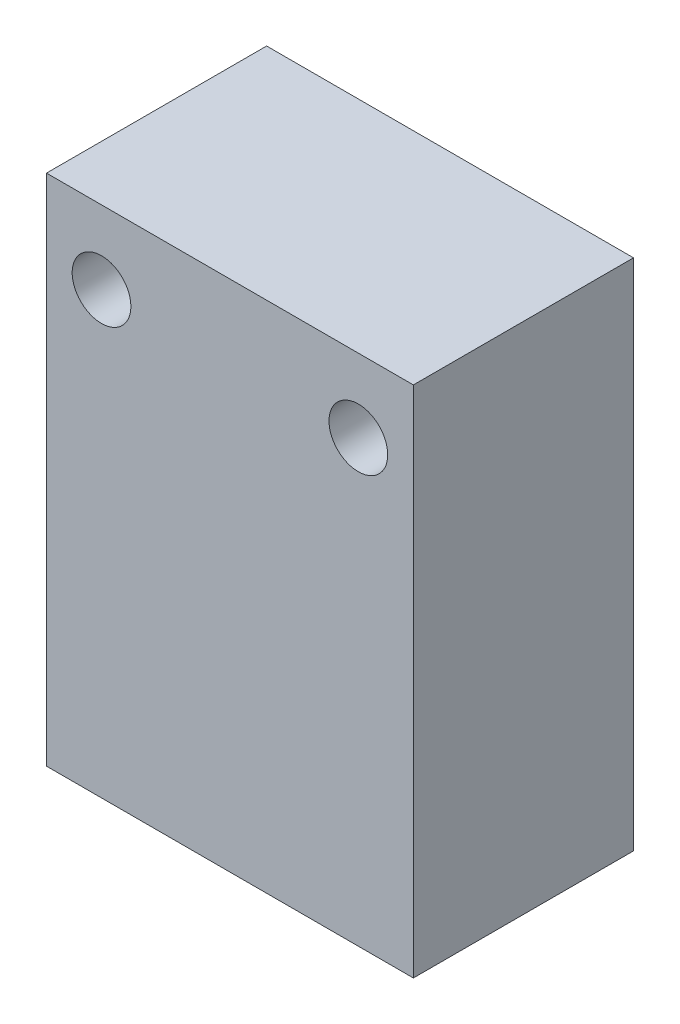
ISO-10303-21;
HEADER;
FILE_DESCRIPTION(('STEP AP214'),'2;1');
FILE_NAME('part.step','',(''),(''),'','','');
FILE_SCHEMA(('AUTOMOTIVE_DESIGN { 1 0 10303 214 1 1 1 1 }'));
ENDSEC;
DATA;
#1=APPLICATION_CONTEXT('core data for automotive mechanical design processes');
#2=APPLICATION_PROTOCOL_DEFINITION('international standard','automotive_design',2000,#1);
#3=PRODUCT_CONTEXT('',#1,'mechanical');
#4=PRODUCT('Part','Part','',(#3));
#5=PRODUCT_RELATED_PRODUCT_CATEGORY('part','',(#4));
#6=PRODUCT_DEFINITION_FORMATION('','',#4);
#7=PRODUCT_DEFINITION_CONTEXT('part definition',#1,'design');
#8=PRODUCT_DEFINITION('design','',#6,#7);
#9=PRODUCT_DEFINITION_SHAPE('','',#8);
#10=(LENGTH_UNIT() NAMED_UNIT(*) SI_UNIT(.MILLI.,.METRE.));
#11=(NAMED_UNIT(*) PLANE_ANGLE_UNIT() SI_UNIT($,.RADIAN.));
#12=(NAMED_UNIT(*) SI_UNIT($,.STERADIAN.) SOLID_ANGLE_UNIT());
#13=UNCERTAINTY_MEASURE_WITH_UNIT(LENGTH_MEASURE(1.E-05),#10,'distance_accuracy_value','');
#14=(GEOMETRIC_REPRESENTATION_CONTEXT(3) GLOBAL_UNCERTAINTY_ASSIGNED_CONTEXT((#13)) GLOBAL_UNIT_ASSIGNED_CONTEXT((#10,
#11,#12)) REPRESENTATION_CONTEXT('',''));
#15=CARTESIAN_POINT('',(0.,0.,0.));
#16=DIRECTION('',(0.,0.,1.));
#17=DIRECTION('',(1.,0.,0.));
#18=AXIS2_PLACEMENT_3D('',#15,#16,#17);
#19=CARTESIAN_POINT('',(-12.9850746268657,11.7164179104478,12.));
#20=DIRECTION('',(1.,0.,0.));
#21=DIRECTION('',(0.,1.,0.));
#22=AXIS2_PLACEMENT_3D('',#19,#20,#21);
#23=PLANE('',#22);
#24=DIRECTION('',(0.,-1.,0.));
#25=VECTOR('',#24,1.);
#26=CARTESIAN_POINT('',(-12.9850746268657,11.7164179104478,0.));
#27=LINE('',#26,#25);
#28=CARTESIAN_POINT('',(-12.9850746268657,11.7164179104478,0.));
#29=VERTEX_POINT('',#28);
#30=CARTESIAN_POINT('',(-12.9850746268657,-16.2835820895522,0.));
#31=VERTEX_POINT('',#30);
#32=EDGE_CURVE('E109',#29,#31,#27,.T.);
#33=ORIENTED_EDGE('',*,*,#32,.T.);
#34=DIRECTION('',(0.,0.,-1.));
#35=VECTOR('',#34,1.);
#36=CARTESIAN_POINT('',(-12.9850746268657,-16.2835820895522,12.));
#37=LINE('',#36,#35);
#38=CARTESIAN_POINT('',(-12.9850746268657,-16.2835820895522,12.));
#39=VERTEX_POINT('',#38);
#40=EDGE_CURVE('E11',#39,#31,#37,.T.);
#41=ORIENTED_EDGE('',*,*,#40,.F.);
#42=DIRECTION('',(0.,-1.,0.));
#43=VECTOR('',#42,1.);
#44=CARTESIAN_POINT('',(-12.9850746268657,11.7164179104478,12.));
#45=LINE('',#44,#43);
#46=CARTESIAN_POINT('',(-12.9850746268657,11.7164179104478,12.));
#47=VERTEX_POINT('',#46);
#48=EDGE_CURVE('E93',#47,#39,#45,.T.);
#49=ORIENTED_EDGE('',*,*,#48,.F.);
#50=DIRECTION('',(0.,0.,-1.));
#51=VECTOR('',#50,1.);
#52=CARTESIAN_POINT('',(-12.9850746268657,11.7164179104478,12.));
#53=LINE('',#52,#51);
#54=EDGE_CURVE('E105',#47,#29,#53,.T.);
#55=ORIENTED_EDGE('',*,*,#54,.T.);
#56=EDGE_LOOP('',(#33,#41,#49,#55));
#57=FACE_BOUND('',#56,.T.);
#58=ADVANCED_FACE('F41',(#57),#23,.F.);
#59=CARTESIAN_POINT('',(-12.9850746268657,-16.2835820895522,12.));
#60=DIRECTION('',(0.,1.,0.));
#61=DIRECTION('',(0.,0.,1.));
#62=AXIS2_PLACEMENT_3D('',#59,#60,#61);
#63=PLANE('',#62);
#64=DIRECTION('',(1.,0.,0.));
#65=VECTOR('',#64,1.);
#66=CARTESIAN_POINT('',(-12.9850746268657,-16.2835820895522,0.));
#67=LINE('',#66,#65);
#68=CARTESIAN_POINT('',(7.01492537313433,-16.2835820895522,0.));
#69=VERTEX_POINT('',#68);
#70=EDGE_CURVE('E98',#31,#69,#67,.T.);
#71=ORIENTED_EDGE('',*,*,#70,.T.);
#72=DIRECTION('',(0.,0.,-1.));
#73=VECTOR('',#72,1.);
#74=CARTESIAN_POINT('',(7.01492537313433,-16.2835820895522,12.));
#75=LINE('',#74,#73);
#76=CARTESIAN_POINT('',(7.01492537313433,-16.2835820895522,12.));
#77=VERTEX_POINT('',#76);
#78=EDGE_CURVE('E50',#77,#69,#75,.T.);
#79=ORIENTED_EDGE('',*,*,#78,.F.);
#80=DIRECTION('',(1.,0.,0.));
#81=VECTOR('',#80,1.);
#82=CARTESIAN_POINT('',(-12.9850746268657,-16.2835820895522,12.));
#83=LINE('',#82,#81);
#84=EDGE_CURVE('E88',#39,#77,#83,.T.);
#85=ORIENTED_EDGE('',*,*,#84,.F.);
#86=ORIENTED_EDGE('',*,*,#40,.T.);
#87=EDGE_LOOP('',(#71,#79,#85,#86));
#88=FACE_BOUND('',#87,.T.);
#89=ADVANCED_FACE('F97',(#88),#63,.F.);
#90=CARTESIAN_POINT('',(7.01492537313433,11.7164179104478,12.));
#91=DIRECTION('',(-1.,0.,0.));
#92=DIRECTION('',(0.,-1.,0.));
#93=AXIS2_PLACEMENT_3D('',#90,#91,#92);
#94=PLANE('',#93);
#95=DIRECTION('',(0.,1.,0.));
#96=VECTOR('',#95,1.);
#97=CARTESIAN_POINT('',(7.01492537313433,11.7164179104478,0.));
#98=LINE('',#97,#96);
#99=CARTESIAN_POINT('',(7.01492537313433,11.7164179104478,0.));
#100=VERTEX_POINT('',#99);
#101=EDGE_CURVE('E75',#69,#100,#98,.T.);
#102=ORIENTED_EDGE('',*,*,#101,.T.);
#103=DIRECTION('',(0.,0.,-1.));
#104=VECTOR('',#103,1.);
#105=CARTESIAN_POINT('',(7.01492537313433,11.7164179104478,12.));
#106=LINE('',#105,#104);
#107=CARTESIAN_POINT('',(7.01492537313433,11.7164179104478,12.));
#108=VERTEX_POINT('',#107);
#109=EDGE_CURVE('E100',#108,#100,#106,.T.);
#110=ORIENTED_EDGE('',*,*,#109,.F.);
#111=DIRECTION('',(0.,1.,0.));
#112=VECTOR('',#111,1.);
#113=CARTESIAN_POINT('',(7.01492537313433,11.7164179104478,12.));
#114=LINE('',#113,#112);
#115=EDGE_CURVE('E91',#77,#108,#114,.T.);
#116=ORIENTED_EDGE('',*,*,#115,.F.);
#117=ORIENTED_EDGE('',*,*,#78,.T.);
#118=EDGE_LOOP('',(#102,#110,#116,#117));
#119=FACE_BOUND('',#118,.T.);
#120=ADVANCED_FACE('F101',(#119),#94,.F.);
#121=CARTESIAN_POINT('',(-12.9850746268657,11.7164179104478,12.));
#122=DIRECTION('',(0.,-1.,0.));
#123=DIRECTION('',(0.,0.,-1.));
#124=AXIS2_PLACEMENT_3D('',#121,#122,#123);
#125=PLANE('',#124);
#126=DIRECTION('',(-1.,0.,0.));
#127=VECTOR('',#126,1.);
#128=CARTESIAN_POINT('',(-12.9850746268657,11.7164179104478,0.));
#129=LINE('',#128,#127);
#130=EDGE_CURVE('E81',#100,#29,#129,.T.);
#131=ORIENTED_EDGE('',*,*,#130,.T.);
#132=ORIENTED_EDGE('',*,*,#54,.F.);
#133=DIRECTION('',(-1.,0.,0.));
#134=VECTOR('',#133,1.);
#135=CARTESIAN_POINT('',(-12.9850746268657,11.7164179104478,12.));
#136=LINE('',#135,#134);
#137=EDGE_CURVE('E58',#108,#47,#136,.T.);
#138=ORIENTED_EDGE('',*,*,#137,.F.);
#139=ORIENTED_EDGE('',*,*,#109,.T.);
#140=EDGE_LOOP('',(#131,#132,#138,#139));
#141=FACE_BOUND('',#140,.T.);
#142=ADVANCED_FACE('F123',(#141),#125,.F.);
#143=CARTESIAN_POINT('',(0.,0.,12.));
#144=DIRECTION('',(0.,0.,1.));
#145=DIRECTION('',(1.,0.,0.));
#146=AXIS2_PLACEMENT_3D('',#143,#144,#145);
#147=PLANE('',#146);
#148=CARTESIAN_POINT('',(-9.98507462686567,7.71641791044777,12.));
#149=DIRECTION('',(0.,0.,1.));
#150=DIRECTION('',(1.,0.,0.));
#151=AXIS2_PLACEMENT_3D('',#148,#149,#150);
#152=CIRCLE('',#151,1.6);
#153=CARTESIAN_POINT('',(-8.38507462686567,7.71641791044777,12.));
#154=VERTEX_POINT('',#153);
#155=EDGE_CURVE('E138',#154,#154,#152,.T.);
#156=ORIENTED_EDGE('',*,*,#155,.F.);
#157=EDGE_LOOP('',(#156));
#158=FACE_BOUND('',#157,.T.);
#159=CARTESIAN_POINT('',(4.01492537313433,7.71641791044777,12.));
#160=DIRECTION('',(0.,0.,1.));
#161=DIRECTION('',(1.,0.,0.));
#162=AXIS2_PLACEMENT_3D('',#159,#160,#161);
#163=CIRCLE('',#162,1.6);
#164=CARTESIAN_POINT('',(5.61492537313433,7.71641791044777,12.));
#165=VERTEX_POINT('',#164);
#166=EDGE_CURVE('E130',#165,#165,#163,.T.);
#167=ORIENTED_EDGE('',*,*,#166,.F.);
#168=EDGE_LOOP('',(#167));
#169=FACE_BOUND('',#168,.T.);
#170=ORIENTED_EDGE('',*,*,#48,.T.);
#171=ORIENTED_EDGE('',*,*,#84,.T.);
#172=ORIENTED_EDGE('',*,*,#115,.T.);
#173=ORIENTED_EDGE('',*,*,#137,.T.);
#174=EDGE_LOOP('',(#170,#171,#172,#173));
#175=FACE_BOUND('',#174,.T.);
#176=ADVANCED_FACE('F89',(#158,#169,#175),#147,.T.);
#177=CARTESIAN_POINT('',(0.,0.,0.));
#178=DIRECTION('',(0.,0.,1.));
#179=DIRECTION('',(1.,0.,0.));
#180=AXIS2_PLACEMENT_3D('',#177,#178,#179);
#181=PLANE('',#180);
#182=CARTESIAN_POINT('',(-9.98507462686567,7.71641791044777,0.));
#183=DIRECTION('',(0.,0.,1.));
#184=DIRECTION('',(1.,0.,0.));
#185=AXIS2_PLACEMENT_3D('',#182,#183,#184);
#186=CIRCLE('',#185,1.6);
#187=CARTESIAN_POINT('',(-8.38507462686567,7.71641791044777,0.));
#188=VERTEX_POINT('',#187);
#189=EDGE_CURVE('E113',#188,#188,#186,.T.);
#190=ORIENTED_EDGE('',*,*,#189,.T.);
#191=EDGE_LOOP('',(#190));
#192=FACE_BOUND('',#191,.T.);
#193=CARTESIAN_POINT('',(4.01492537313433,7.71641791044777,0.));
#194=DIRECTION('',(0.,0.,1.));
#195=DIRECTION('',(1.,0.,0.));
#196=AXIS2_PLACEMENT_3D('',#193,#194,#195);
#197=CIRCLE('',#196,1.6);
#198=CARTESIAN_POINT('',(5.61492537313433,7.71641791044777,0.));
#199=VERTEX_POINT('',#198);
#200=EDGE_CURVE('E134',#199,#199,#197,.T.);
#201=ORIENTED_EDGE('',*,*,#200,.T.);
#202=EDGE_LOOP('',(#201));
#203=FACE_BOUND('',#202,.T.);
#204=ORIENTED_EDGE('',*,*,#32,.F.);
#205=ORIENTED_EDGE('',*,*,#130,.F.);
#206=ORIENTED_EDGE('',*,*,#101,.F.);
#207=ORIENTED_EDGE('',*,*,#70,.F.);
#208=EDGE_LOOP('',(#204,#205,#206,#207));
#209=FACE_BOUND('',#208,.T.);
#210=ADVANCED_FACE('F126',(#192,#203,#209),#181,.F.);
#211=CARTESIAN_POINT('',(4.01492537313433,7.71641791044777,0.));
#212=DIRECTION('',(0.,0.,1.));
#213=DIRECTION('',(1.,0.,0.));
#214=AXIS2_PLACEMENT_3D('',#211,#212,#213);
#215=CYLINDRICAL_SURFACE('',#214,1.6);
#216=ORIENTED_EDGE('',*,*,#200,.F.);
#217=EDGE_LOOP('',(#216));
#218=FACE_BOUND('',#217,.T.);
#219=ORIENTED_EDGE('',*,*,#166,.T.);
#220=EDGE_LOOP('',(#219));
#221=FACE_BOUND('',#220,.T.);
#222=ADVANCED_FACE('F151',(#218,#221),#215,.F.);
#223=CARTESIAN_POINT('',(-9.98507462686567,7.71641791044777,0.));
#224=DIRECTION('',(0.,0.,1.));
#225=DIRECTION('',(1.,0.,0.));
#226=AXIS2_PLACEMENT_3D('',#223,#224,#225);
#227=CYLINDRICAL_SURFACE('',#226,1.6);
#228=ORIENTED_EDGE('',*,*,#189,.F.);
#229=EDGE_LOOP('',(#228));
#230=FACE_BOUND('',#229,.T.);
#231=ORIENTED_EDGE('',*,*,#155,.T.);
#232=EDGE_LOOP('',(#231));
#233=FACE_BOUND('',#232,.T.);
#234=ADVANCED_FACE('F148',(#230,#233),#227,.F.);
#235=CLOSED_SHELL('',(#58,#89,#120,#142,#176,#210,#222,#234));
#236=MANIFOLD_SOLID_BREP('B2',#235);
#237=ADVANCED_BREP_SHAPE_REPRESENTATION('',(#18,#236),#14);
#238=SHAPE_DEFINITION_REPRESENTATION(#9,#237);
ENDSEC;
END-ISO-10303-21;
